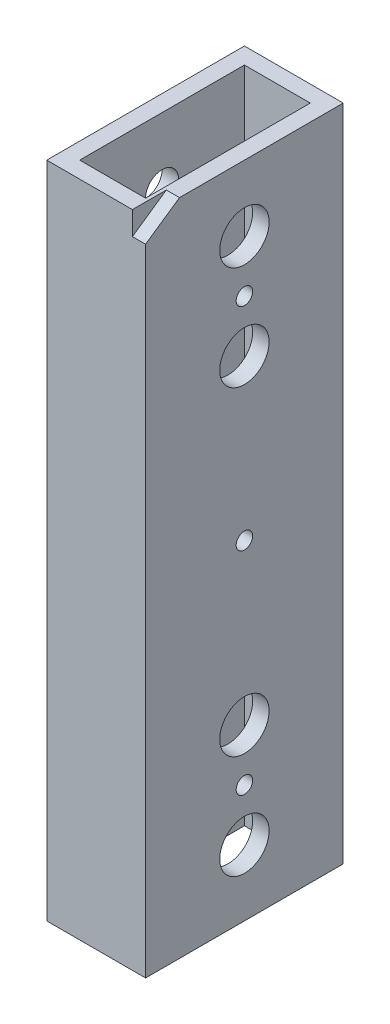
ISO-10303-21;
HEADER;
FILE_DESCRIPTION(('STEP AP214'),'2;1');
FILE_NAME('part.step','',(''),(''),'','','');
FILE_SCHEMA(('AUTOMOTIVE_DESIGN { 1 0 10303 214 1 1 1 1 }'));
ENDSEC;
DATA;
#1=APPLICATION_CONTEXT('core data for automotive mechanical design processes');
#2=APPLICATION_PROTOCOL_DEFINITION('international standard','automotive_design',2000,#1);
#3=PRODUCT_CONTEXT('',#1,'mechanical');
#4=PRODUCT('Part','Part','',(#3));
#5=PRODUCT_RELATED_PRODUCT_CATEGORY('part','',(#4));
#6=PRODUCT_DEFINITION_FORMATION('','',#4);
#7=PRODUCT_DEFINITION_CONTEXT('part definition',#1,'design');
#8=PRODUCT_DEFINITION('design','',#6,#7);
#9=PRODUCT_DEFINITION_SHAPE('','',#8);
#10=(LENGTH_UNIT() NAMED_UNIT(*) SI_UNIT(.MILLI.,.METRE.));
#11=(NAMED_UNIT(*) PLANE_ANGLE_UNIT() SI_UNIT($,.RADIAN.));
#12=(NAMED_UNIT(*) SI_UNIT($,.STERADIAN.) SOLID_ANGLE_UNIT());
#13=UNCERTAINTY_MEASURE_WITH_UNIT(LENGTH_MEASURE(1.E-05),#10,'distance_accuracy_value','');
#14=(GEOMETRIC_REPRESENTATION_CONTEXT(3) GLOBAL_UNCERTAINTY_ASSIGNED_CONTEXT((#13)) GLOBAL_UNIT_ASSIGNED_CONTEXT((#10,
#11,#12)) REPRESENTATION_CONTEXT('',''));
#15=CARTESIAN_POINT('',(0.,0.,0.));
#16=DIRECTION('',(0.,0.,1.));
#17=DIRECTION('',(1.,0.,0.));
#18=AXIS2_PLACEMENT_3D('',#15,#16,#17);
#19=CARTESIAN_POINT('',(0.,127.,0.));
#20=DIRECTION('',(0.,-1.,0.));
#21=DIRECTION('',(0.,0.,-1.));
#22=AXIS2_PLACEMENT_3D('',#19,#20,#21);
#23=PLANE('',#22);
#24=DIRECTION('',(0.,0.,1.));
#25=VECTOR('',#24,1.);
#26=CARTESIAN_POINT('',(16.51,127.,0.));
#27=LINE('',#26,#25);
#28=CARTESIAN_POINT('',(16.51,127.,-6.53736659995729));
#29=VERTEX_POINT('',#28);
#30=CARTESIAN_POINT('',(16.51,127.,0.));
#31=VERTEX_POINT('',#30);
#32=EDGE_CURVE('E129',#29,#31,#27,.T.);
#33=ORIENTED_EDGE('',*,*,#32,.F.);
#34=DIRECTION('',(1.,0.,0.));
#35=VECTOR('',#34,1.);
#36=CARTESIAN_POINT('',(16.51,127.,-6.53736659995729));
#37=LINE('',#36,#35);
#38=CARTESIAN_POINT('',(19.05,127.,-6.53736659995729));
#39=VERTEX_POINT('',#38);
#40=EDGE_CURVE('E126',#29,#39,#37,.T.);
#41=ORIENTED_EDGE('',*,*,#40,.T.);
#42=DIRECTION('',(0.,0.,-1.));
#43=VECTOR('',#42,1.);
#44=CARTESIAN_POINT('',(19.05,127.,0.));
#45=LINE('',#44,#43);
#46=CARTESIAN_POINT('',(19.05,127.,-38.1));
#47=VERTEX_POINT('',#46);
#48=EDGE_CURVE('E266',#39,#47,#45,.T.);
#49=ORIENTED_EDGE('',*,*,#48,.T.);
#50=DIRECTION('',(-1.,0.,0.));
#51=VECTOR('',#50,1.);
#52=CARTESIAN_POINT('',(0.,127.,-38.1));
#53=LINE('',#52,#51);
#54=CARTESIAN_POINT('',(0.,127.,-38.1));
#55=VERTEX_POINT('',#54);
#56=EDGE_CURVE('E269',#47,#55,#53,.T.);
#57=ORIENTED_EDGE('',*,*,#56,.T.);
#58=DIRECTION('',(0.,0.,1.));
#59=VECTOR('',#58,1.);
#60=CARTESIAN_POINT('',(0.,127.,0.));
#61=LINE('',#60,#59);
#62=CARTESIAN_POINT('',(0.,127.,0.));
#63=VERTEX_POINT('',#62);
#64=EDGE_CURVE('E259',#55,#63,#61,.T.);
#65=ORIENTED_EDGE('',*,*,#64,.T.);
#66=DIRECTION('',(1.,0.,0.));
#67=VECTOR('',#66,1.);
#68=CARTESIAN_POINT('',(0.,127.,0.));
#69=LINE('',#68,#67);
#70=EDGE_CURVE('E263',#63,#31,#69,.T.);
#71=ORIENTED_EDGE('',*,*,#70,.T.);
#72=EDGE_LOOP('',(#33,#41,#49,#57,#65,#71));
#73=FACE_BOUND('',#72,.T.);
#74=DIRECTION('',(0.,0.,1.));
#75=VECTOR('',#74,1.);
#76=CARTESIAN_POINT('',(3.175,127.,-3.175));
#77=LINE('',#76,#75);
#78=CARTESIAN_POINT('',(3.175,127.,-34.925));
#79=VERTEX_POINT('',#78);
#80=CARTESIAN_POINT('',(3.175,127.,-3.175));
#81=VERTEX_POINT('',#80);
#82=EDGE_CURVE('E225',#79,#81,#77,.T.);
#83=ORIENTED_EDGE('',*,*,#82,.F.);
#84=DIRECTION('',(-1.,0.,0.));
#85=VECTOR('',#84,1.);
#86=CARTESIAN_POINT('',(3.175,127.,-34.925));
#87=LINE('',#86,#85);
#88=CARTESIAN_POINT('',(15.875,127.,-34.925));
#89=VERTEX_POINT('',#88);
#90=EDGE_CURVE('E234',#89,#79,#87,.T.);
#91=ORIENTED_EDGE('',*,*,#90,.F.);
#92=DIRECTION('',(0.,0.,-1.));
#93=VECTOR('',#92,1.);
#94=CARTESIAN_POINT('',(15.875,127.,-3.175));
#95=LINE('',#94,#93);
#96=CARTESIAN_POINT('',(15.875,127.,-3.175));
#97=VERTEX_POINT('',#96);
#98=EDGE_CURVE('E231',#97,#89,#95,.T.);
#99=ORIENTED_EDGE('',*,*,#98,.F.);
#100=DIRECTION('',(1.,0.,0.));
#101=VECTOR('',#100,1.);
#102=CARTESIAN_POINT('',(3.175,127.,-3.175));
#103=LINE('',#102,#101);
#104=EDGE_CURVE('E228',#81,#97,#103,.T.);
#105=ORIENTED_EDGE('',*,*,#104,.F.);
#106=EDGE_LOOP('',(#83,#91,#99,#105));
#107=FACE_BOUND('',#106,.T.);
#108=ADVANCED_FACE('F41',(#73,#107),#23,.F.);
#109=CARTESIAN_POINT('',(0.,0.,0.));
#110=DIRECTION('',(0.,-1.,0.));
#111=DIRECTION('',(0.,0.,-1.));
#112=AXIS2_PLACEMENT_3D('',#109,#110,#111);
#113=PLANE('',#112);
#114=DIRECTION('',(0.,0.,1.));
#115=VECTOR('',#114,1.);
#116=CARTESIAN_POINT('',(0.,0.,0.));
#117=LINE('',#116,#115);
#118=CARTESIAN_POINT('',(0.,0.,-38.1));
#119=VERTEX_POINT('',#118);
#120=CARTESIAN_POINT('',(0.,0.,0.));
#121=VERTEX_POINT('',#120);
#122=EDGE_CURVE('E258',#119,#121,#117,.T.);
#123=ORIENTED_EDGE('',*,*,#122,.F.);
#124=DIRECTION('',(-1.,0.,0.));
#125=VECTOR('',#124,1.);
#126=CARTESIAN_POINT('',(0.,0.,-38.1));
#127=LINE('',#126,#125);
#128=CARTESIAN_POINT('',(19.05,0.,-38.1));
#129=VERTEX_POINT('',#128);
#130=EDGE_CURVE('E264',#129,#119,#127,.T.);
#131=ORIENTED_EDGE('',*,*,#130,.F.);
#132=DIRECTION('',(0.,0.,-1.));
#133=VECTOR('',#132,1.);
#134=CARTESIAN_POINT('',(19.05,0.,0.));
#135=LINE('',#134,#133);
#136=CARTESIAN_POINT('',(19.05,0.,0.));
#137=VERTEX_POINT('',#136);
#138=EDGE_CURVE('E277',#137,#129,#135,.T.);
#139=ORIENTED_EDGE('',*,*,#138,.F.);
#140=DIRECTION('',(1.,0.,0.));
#141=VECTOR('',#140,1.);
#142=CARTESIAN_POINT('',(0.,0.,0.));
#143=LINE('',#142,#141);
#144=EDGE_CURVE('E275',#121,#137,#143,.T.);
#145=ORIENTED_EDGE('',*,*,#144,.F.);
#146=EDGE_LOOP('',(#123,#131,#139,#145));
#147=FACE_BOUND('',#146,.T.);
#148=DIRECTION('',(-1.,0.,0.));
#149=VECTOR('',#148,1.);
#150=CARTESIAN_POINT('',(3.175,0.,-34.925));
#151=LINE('',#150,#149);
#152=CARTESIAN_POINT('',(15.875,0.,-34.925));
#153=VERTEX_POINT('',#152);
#154=CARTESIAN_POINT('',(3.175,0.,-34.925));
#155=VERTEX_POINT('',#154);
#156=EDGE_CURVE('E229',#153,#155,#151,.T.);
#157=ORIENTED_EDGE('',*,*,#156,.T.);
#158=DIRECTION('',(0.,0.,1.));
#159=VECTOR('',#158,1.);
#160=CARTESIAN_POINT('',(3.175,0.,-3.175));
#161=LINE('',#160,#159);
#162=CARTESIAN_POINT('',(3.175,0.,-3.175));
#163=VERTEX_POINT('',#162);
#164=EDGE_CURVE('E224',#155,#163,#161,.T.);
#165=ORIENTED_EDGE('',*,*,#164,.T.);
#166=DIRECTION('',(1.,0.,0.));
#167=VECTOR('',#166,1.);
#168=CARTESIAN_POINT('',(3.175,0.,-3.175));
#169=LINE('',#168,#167);
#170=CARTESIAN_POINT('',(15.875,0.,-3.175));
#171=VERTEX_POINT('',#170);
#172=EDGE_CURVE('E240',#163,#171,#169,.T.);
#173=ORIENTED_EDGE('',*,*,#172,.T.);
#174=DIRECTION('',(0.,0.,-1.));
#175=VECTOR('',#174,1.);
#176=CARTESIAN_POINT('',(15.875,0.,-3.175));
#177=LINE('',#176,#175);
#178=EDGE_CURVE('E243',#171,#153,#177,.T.);
#179=ORIENTED_EDGE('',*,*,#178,.T.);
#180=EDGE_LOOP('',(#157,#165,#173,#179));
#181=FACE_BOUND('',#180,.T.);
#182=ADVANCED_FACE('F320',(#147,#181),#113,.T.);
#183=CARTESIAN_POINT('',(0.,127.,0.));
#184=DIRECTION('',(1.,0.,0.));
#185=DIRECTION('',(0.,0.,-1.));
#186=AXIS2_PLACEMENT_3D('',#183,#184,#185);
#187=PLANE('',#186);
#188=CARTESIAN_POINT('',(0.,104.30002,-19.05));
#189=DIRECTION('',(-1.,0.,0.));
#190=DIRECTION('',(0.,0.,1.));
#191=AXIS2_PLACEMENT_3D('',#188,#189,#190);
#192=CIRCLE('',#191,4.7625);
#193=CARTESIAN_POINT('',(0.,104.30002,-14.2875));
#194=VERTEX_POINT('',#193);
#195=EDGE_CURVE('E147',#194,#194,#192,.T.);
#196=ORIENTED_EDGE('',*,*,#195,.F.);
#197=EDGE_LOOP('',(#196));
#198=FACE_BOUND('',#197,.T.);
#199=CARTESIAN_POINT('',(0.,63.5,-19.05));
#200=DIRECTION('',(-1.,0.,0.));
#201=DIRECTION('',(0.,0.,1.));
#202=AXIS2_PLACEMENT_3D('',#199,#200,#201);
#203=CIRCLE('',#202,4.7625);
#204=CARTESIAN_POINT('',(0.,63.5,-14.2875));
#205=VERTEX_POINT('',#204);
#206=EDGE_CURVE('E154',#205,#205,#203,.T.);
#207=ORIENTED_EDGE('',*,*,#206,.F.);
#208=EDGE_LOOP('',(#207));
#209=FACE_BOUND('',#208,.T.);
#210=CARTESIAN_POINT('',(0.,22.69998,-19.05));
#211=DIRECTION('',(-1.,0.,0.));
#212=DIRECTION('',(0.,0.,1.));
#213=AXIS2_PLACEMENT_3D('',#210,#211,#212);
#214=CIRCLE('',#213,4.7625);
#215=CARTESIAN_POINT('',(0.,22.69998,-14.2875));
#216=VERTEX_POINT('',#215);
#217=EDGE_CURVE('E160',#216,#216,#214,.T.);
#218=ORIENTED_EDGE('',*,*,#217,.F.);
#219=EDGE_LOOP('',(#218));
#220=FACE_BOUND('',#219,.T.);
#221=CARTESIAN_POINT('',(0.,12.7,-19.05));
#222=DIRECTION('',(1.,0.,0.));
#223=DIRECTION('',(0.,0.,-1.));
#224=AXIS2_PLACEMENT_3D('',#221,#222,#223);
#225=CIRCLE('',#224,3.175);
#226=CARTESIAN_POINT('',(0.,12.7,-22.225));
#227=VERTEX_POINT('',#226);
#228=EDGE_CURVE('E201',#227,#227,#225,.T.);
#229=ORIENTED_EDGE('',*,*,#228,.T.);
#230=EDGE_LOOP('',(#229));
#231=FACE_BOUND('',#230,.T.);
#232=CARTESIAN_POINT('',(0.,32.69996,-19.05));
#233=DIRECTION('',(1.,0.,0.));
#234=DIRECTION('',(0.,0.,-1.));
#235=AXIS2_PLACEMENT_3D('',#232,#233,#234);
#236=CIRCLE('',#235,3.175);
#237=CARTESIAN_POINT('',(0.,32.69996,-22.225));
#238=VERTEX_POINT('',#237);
#239=EDGE_CURVE('E205',#238,#238,#236,.T.);
#240=ORIENTED_EDGE('',*,*,#239,.T.);
#241=EDGE_LOOP('',(#240));
#242=FACE_BOUND('',#241,.T.);
#243=CARTESIAN_POINT('',(0.,94.30004,-19.05));
#244=DIRECTION('',(1.,0.,0.));
#245=DIRECTION('',(0.,0.,1.));
#246=AXIS2_PLACEMENT_3D('',#243,#244,#245);
#247=CIRCLE('',#246,3.175);
#248=CARTESIAN_POINT('',(0.,94.30004,-15.875));
#249=VERTEX_POINT('',#248);
#250=EDGE_CURVE('E208',#249,#249,#247,.T.);
#251=ORIENTED_EDGE('',*,*,#250,.T.);
#252=EDGE_LOOP('',(#251));
#253=FACE_BOUND('',#252,.T.);
#254=CARTESIAN_POINT('',(0.,114.3,-19.05));
#255=DIRECTION('',(1.,0.,0.));
#256=DIRECTION('',(0.,0.,1.));
#257=AXIS2_PLACEMENT_3D('',#254,#255,#256);
#258=CIRCLE('',#257,3.175);
#259=CARTESIAN_POINT('',(0.,114.3,-15.875));
#260=VERTEX_POINT('',#259);
#261=EDGE_CURVE('E178',#260,#260,#258,.T.);
#262=ORIENTED_EDGE('',*,*,#261,.T.);
#263=EDGE_LOOP('',(#262));
#264=FACE_BOUND('',#263,.T.);
#265=ORIENTED_EDGE('',*,*,#122,.T.);
#266=DIRECTION('',(0.,-1.,0.));
#267=VECTOR('',#266,1.);
#268=CARTESIAN_POINT('',(0.,127.,0.));
#269=LINE('',#268,#267);
#270=EDGE_CURVE('E11',#63,#121,#269,.T.);
#271=ORIENTED_EDGE('',*,*,#270,.F.);
#272=ORIENTED_EDGE('',*,*,#64,.F.);
#273=DIRECTION('',(0.,-1.,0.));
#274=VECTOR('',#273,1.);
#275=CARTESIAN_POINT('',(0.,127.,-38.1));
#276=LINE('',#275,#274);
#277=EDGE_CURVE('E272',#55,#119,#276,.T.);
#278=ORIENTED_EDGE('',*,*,#277,.T.);
#279=EDGE_LOOP('',(#265,#271,#272,#278));
#280=FACE_BOUND('',#279,.T.);
#281=ADVANCED_FACE('F43',(#198,#209,#220,#231,#242,#253,#264,#280),#187,.F.);
#282=CARTESIAN_POINT('',(0.,127.,0.));
#283=DIRECTION('',(0.,0.,-1.));
#284=DIRECTION('',(-1.,0.,0.));
#285=AXIS2_PLACEMENT_3D('',#282,#283,#284);
#286=PLANE('',#285);
#287=DIRECTION('',(0.,-1.,0.));
#288=VECTOR('',#287,1.);
#289=CARTESIAN_POINT('',(19.05,127.,0.));
#290=LINE('',#289,#288);
#291=CARTESIAN_POINT('',(19.05,122.487604509899,0.));
#292=VERTEX_POINT('',#291);
#293=EDGE_CURVE('E50',#292,#137,#290,.T.);
#294=ORIENTED_EDGE('',*,*,#293,.F.);
#295=DIRECTION('',(1.,0.,0.));
#296=VECTOR('',#295,1.);
#297=CARTESIAN_POINT('',(16.51,122.487604509899,0.));
#298=LINE('',#297,#296);
#299=CARTESIAN_POINT('',(16.51,122.487604509899,0.));
#300=VERTEX_POINT('',#299);
#301=EDGE_CURVE('E58',#300,#292,#298,.T.);
#302=ORIENTED_EDGE('',*,*,#301,.F.);
#303=DIRECTION('',(0.,-1.,0.));
#304=VECTOR('',#303,1.);
#305=CARTESIAN_POINT('',(16.51,122.487604509899,0.));
#306=LINE('',#305,#304);
#307=EDGE_CURVE('E130',#31,#300,#306,.T.);
#308=ORIENTED_EDGE('',*,*,#307,.F.);
#309=ORIENTED_EDGE('',*,*,#70,.F.);
#310=ORIENTED_EDGE('',*,*,#270,.T.);
#311=ORIENTED_EDGE('',*,*,#144,.T.);
#312=EDGE_LOOP('',(#294,#302,#308,#309,#310,#311));
#313=FACE_BOUND('',#312,.T.);
#314=ADVANCED_FACE('F139',(#313),#286,.F.);
#315=CARTESIAN_POINT('',(19.05,127.,0.));
#316=DIRECTION('',(-1.,0.,0.));
#317=DIRECTION('',(0.,0.,1.));
#318=AXIS2_PLACEMENT_3D('',#315,#316,#317);
#319=PLANE('',#318);
#320=CARTESIAN_POINT('',(19.05,22.69998,-19.05));
#321=DIRECTION('',(1.,0.,0.));
#322=DIRECTION('',(0.,0.,-1.));
#323=AXIS2_PLACEMENT_3D('',#320,#321,#322);
#324=CIRCLE('',#323,1.5875);
#325=CARTESIAN_POINT('',(19.05,22.69998,-20.6375));
#326=VERTEX_POINT('',#325);
#327=EDGE_CURVE('E165',#326,#326,#324,.T.);
#328=ORIENTED_EDGE('',*,*,#327,.F.);
#329=EDGE_LOOP('',(#328));
#330=FACE_BOUND('',#329,.T.);
#331=CARTESIAN_POINT('',(19.05,63.5,-19.05));
#332=DIRECTION('',(1.,0.,0.));
#333=DIRECTION('',(0.,0.,-1.));
#334=AXIS2_PLACEMENT_3D('',#331,#332,#333);
#335=CIRCLE('',#334,1.5875);
#336=CARTESIAN_POINT('',(19.05,63.5,-20.6375));
#337=VERTEX_POINT('',#336);
#338=EDGE_CURVE('E169',#337,#337,#335,.T.);
#339=ORIENTED_EDGE('',*,*,#338,.F.);
#340=EDGE_LOOP('',(#339));
#341=FACE_BOUND('',#340,.T.);
#342=CARTESIAN_POINT('',(19.05,104.30002,-19.05));
#343=DIRECTION('',(1.,0.,0.));
#344=DIRECTION('',(0.,0.,1.));
#345=AXIS2_PLACEMENT_3D('',#342,#343,#344);
#346=CIRCLE('',#345,1.5875);
#347=CARTESIAN_POINT('',(19.05,104.30002,-17.4625));
#348=VERTEX_POINT('',#347);
#349=EDGE_CURVE('E150',#348,#348,#346,.T.);
#350=ORIENTED_EDGE('',*,*,#349,.F.);
#351=EDGE_LOOP('',(#350));
#352=FACE_BOUND('',#351,.T.);
#353=CARTESIAN_POINT('',(19.05,114.3,-19.05));
#354=DIRECTION('',(1.,0.,0.));
#355=DIRECTION('',(0.,0.,-1.));
#356=AXIS2_PLACEMENT_3D('',#353,#354,#355);
#357=CIRCLE('',#356,4.7625);
#358=CARTESIAN_POINT('',(19.05,114.3,-23.8125));
#359=VERTEX_POINT('',#358);
#360=EDGE_CURVE('E174',#359,#359,#357,.T.);
#361=ORIENTED_EDGE('',*,*,#360,.F.);
#362=EDGE_LOOP('',(#361));
#363=FACE_BOUND('',#362,.T.);
#364=CARTESIAN_POINT('',(19.05,94.30004,-19.05));
#365=DIRECTION('',(1.,0.,0.));
#366=DIRECTION('',(0.,0.,-1.));
#367=AXIS2_PLACEMENT_3D('',#364,#365,#366);
#368=CIRCLE('',#367,4.7625);
#369=CARTESIAN_POINT('',(19.05,94.30004,-23.8125));
#370=VERTEX_POINT('',#369);
#371=EDGE_CURVE('E183',#370,#370,#368,.T.);
#372=ORIENTED_EDGE('',*,*,#371,.F.);
#373=EDGE_LOOP('',(#372));
#374=FACE_BOUND('',#373,.T.);
#375=CARTESIAN_POINT('',(19.05,32.69996,-19.05));
#376=DIRECTION('',(1.,0.,0.));
#377=DIRECTION('',(0.,0.,-1.));
#378=AXIS2_PLACEMENT_3D('',#375,#376,#377);
#379=CIRCLE('',#378,4.7625);
#380=CARTESIAN_POINT('',(19.05,32.69996,-23.8125));
#381=VERTEX_POINT('',#380);
#382=EDGE_CURVE('E189',#381,#381,#379,.T.);
#383=ORIENTED_EDGE('',*,*,#382,.F.);
#384=EDGE_LOOP('',(#383));
#385=FACE_BOUND('',#384,.T.);
#386=CARTESIAN_POINT('',(19.05,12.7,-19.05));
#387=DIRECTION('',(1.,0.,0.));
#388=DIRECTION('',(0.,0.,-1.));
#389=AXIS2_PLACEMENT_3D('',#386,#387,#388);
#390=CIRCLE('',#389,4.7625);
#391=CARTESIAN_POINT('',(19.05,12.7,-23.8125));
#392=VERTEX_POINT('',#391);
#393=EDGE_CURVE('E195',#392,#392,#390,.T.);
#394=ORIENTED_EDGE('',*,*,#393,.F.);
#395=EDGE_LOOP('',(#394));
#396=FACE_BOUND('',#395,.T.);
#397=ORIENTED_EDGE('',*,*,#48,.F.);
#398=DIRECTION('',(0.,0.568062797194208,-0.822985211558441));
#399=VECTOR('',#398,1.);
#400=CARTESIAN_POINT('',(19.05,127.,-6.53736659995729));
#401=LINE('',#400,#399);
#402=EDGE_CURVE('E136',#292,#39,#401,.T.);
#403=ORIENTED_EDGE('',*,*,#402,.F.);
#404=ORIENTED_EDGE('',*,*,#293,.T.);
#405=ORIENTED_EDGE('',*,*,#138,.T.);
#406=DIRECTION('',(0.,-1.,0.));
#407=VECTOR('',#406,1.);
#408=CARTESIAN_POINT('',(19.05,127.,-38.1));
#409=LINE('',#408,#407);
#410=EDGE_CURVE('E283',#47,#129,#409,.T.);
#411=ORIENTED_EDGE('',*,*,#410,.F.);
#412=EDGE_LOOP('',(#397,#403,#404,#405,#411));
#413=FACE_BOUND('',#412,.T.);
#414=ADVANCED_FACE('F356',(#330,#341,#352,#363,#374,#385,#396,#413),#319,.F.);
#415=CARTESIAN_POINT('',(0.,127.,-38.1));
#416=DIRECTION('',(0.,0.,1.));
#417=DIRECTION('',(1.,0.,0.));
#418=AXIS2_PLACEMENT_3D('',#415,#416,#417);
#419=PLANE('',#418);
#420=ORIENTED_EDGE('',*,*,#130,.T.);
#421=ORIENTED_EDGE('',*,*,#277,.F.);
#422=ORIENTED_EDGE('',*,*,#56,.F.);
#423=ORIENTED_EDGE('',*,*,#410,.T.);
#424=EDGE_LOOP('',(#420,#421,#422,#423));
#425=FACE_BOUND('',#424,.T.);
#426=ADVANCED_FACE('F353',(#425),#419,.F.);
#427=CARTESIAN_POINT('',(3.175,127.,-3.175));
#428=DIRECTION('',(1.,0.,0.));
#429=DIRECTION('',(0.,0.,-1.));
#430=AXIS2_PLACEMENT_3D('',#427,#428,#429);
#431=PLANE('',#430);
#432=CARTESIAN_POINT('',(3.175,104.30002,-19.05));
#433=DIRECTION('',(1.,0.,0.));
#434=DIRECTION('',(0.,0.,-1.));
#435=AXIS2_PLACEMENT_3D('',#432,#433,#434);
#436=CIRCLE('',#435,4.7625);
#437=CARTESIAN_POINT('',(3.175,104.30002,-23.8125));
#438=VERTEX_POINT('',#437);
#439=EDGE_CURVE('E151',#438,#438,#436,.F.);
#440=ORIENTED_EDGE('',*,*,#439,.T.);
#441=EDGE_LOOP('',(#440));
#442=FACE_BOUND('',#441,.T.);
#443=CARTESIAN_POINT('',(3.175,63.5,-19.05));
#444=DIRECTION('',(1.,0.,0.));
#445=DIRECTION('',(0.,0.,-1.));
#446=AXIS2_PLACEMENT_3D('',#443,#444,#445);
#447=CIRCLE('',#446,4.7625);
#448=CARTESIAN_POINT('',(3.175,63.5,-23.8125));
#449=VERTEX_POINT('',#448);
#450=EDGE_CURVE('E157',#449,#449,#447,.F.);
#451=ORIENTED_EDGE('',*,*,#450,.T.);
#452=EDGE_LOOP('',(#451));
#453=FACE_BOUND('',#452,.T.);
#454=CARTESIAN_POINT('',(3.175,22.69998,-19.05));
#455=DIRECTION('',(1.,0.,0.));
#456=DIRECTION('',(0.,0.,-1.));
#457=AXIS2_PLACEMENT_3D('',#454,#455,#456);
#458=CIRCLE('',#457,4.7625);
#459=CARTESIAN_POINT('',(3.175,22.69998,-23.8125));
#460=VERTEX_POINT('',#459);
#461=EDGE_CURVE('E142',#460,#460,#458,.F.);
#462=ORIENTED_EDGE('',*,*,#461,.T.);
#463=EDGE_LOOP('',(#462));
#464=FACE_BOUND('',#463,.T.);
#465=CARTESIAN_POINT('',(3.175,12.7,-19.05));
#466=DIRECTION('',(1.,0.,0.));
#467=DIRECTION('',(0.,0.,-1.));
#468=AXIS2_PLACEMENT_3D('',#465,#466,#467);
#469=CIRCLE('',#468,3.175);
#470=CARTESIAN_POINT('',(3.175,12.7,-22.225));
#471=VERTEX_POINT('',#470);
#472=EDGE_CURVE('E221',#471,#471,#469,.T.);
#473=ORIENTED_EDGE('',*,*,#472,.F.);
#474=EDGE_LOOP('',(#473));
#475=FACE_BOUND('',#474,.T.);
#476=CARTESIAN_POINT('',(3.175,32.69996,-19.05));
#477=DIRECTION('',(1.,0.,0.));
#478=DIRECTION('',(0.,0.,-1.));
#479=AXIS2_PLACEMENT_3D('',#476,#477,#478);
#480=CIRCLE('',#479,3.175);
#481=CARTESIAN_POINT('',(3.175,32.69996,-22.225));
#482=VERTEX_POINT('',#481);
#483=EDGE_CURVE('E218',#482,#482,#480,.T.);
#484=ORIENTED_EDGE('',*,*,#483,.F.);
#485=EDGE_LOOP('',(#484));
#486=FACE_BOUND('',#485,.T.);
#487=CARTESIAN_POINT('',(3.175,94.30004,-19.05));
#488=DIRECTION('',(1.,0.,0.));
#489=DIRECTION('',(0.,0.,-1.));
#490=AXIS2_PLACEMENT_3D('',#487,#488,#489);
#491=CIRCLE('',#490,3.175);
#492=CARTESIAN_POINT('',(3.175,94.30004,-22.225));
#493=VERTEX_POINT('',#492);
#494=EDGE_CURVE('E215',#493,#493,#491,.T.);
#495=ORIENTED_EDGE('',*,*,#494,.F.);
#496=EDGE_LOOP('',(#495));
#497=FACE_BOUND('',#496,.T.);
#498=CARTESIAN_POINT('',(3.175,114.3,-19.05));
#499=DIRECTION('',(1.,0.,0.));
#500=DIRECTION('',(0.,0.,-1.));
#501=AXIS2_PLACEMENT_3D('',#498,#499,#500);
#502=CIRCLE('',#501,3.175);
#503=CARTESIAN_POINT('',(3.175,114.3,-22.225));
#504=VERTEX_POINT('',#503);
#505=EDGE_CURVE('E204',#504,#504,#502,.T.);
#506=ORIENTED_EDGE('',*,*,#505,.F.);
#507=EDGE_LOOP('',(#506));
#508=FACE_BOUND('',#507,.T.);
#509=ORIENTED_EDGE('',*,*,#164,.F.);
#510=DIRECTION('',(0.,-1.,0.));
#511=VECTOR('',#510,1.);
#512=CARTESIAN_POINT('',(3.175,127.,-34.925));
#513=LINE('',#512,#511);
#514=EDGE_CURVE('E237',#79,#155,#513,.T.);
#515=ORIENTED_EDGE('',*,*,#514,.F.);
#516=ORIENTED_EDGE('',*,*,#82,.T.);
#517=DIRECTION('',(0.,-1.,0.));
#518=VECTOR('',#517,1.);
#519=CARTESIAN_POINT('',(3.175,127.,-3.175));
#520=LINE('',#519,#518);
#521=EDGE_CURVE('E255',#81,#163,#520,.T.);
#522=ORIENTED_EDGE('',*,*,#521,.T.);
#523=EDGE_LOOP('',(#509,#515,#516,#522));
#524=FACE_BOUND('',#523,.T.);
#525=ADVANCED_FACE('F325',(#442,#453,#464,#475,#486,#497,#508,#524),#431,.T.);
#526=CARTESIAN_POINT('',(3.175,127.,-3.175));
#527=DIRECTION('',(0.,0.,-1.));
#528=DIRECTION('',(-1.,0.,0.));
#529=AXIS2_PLACEMENT_3D('',#526,#527,#528);
#530=PLANE('',#529);
#531=ORIENTED_EDGE('',*,*,#172,.F.);
#532=ORIENTED_EDGE('',*,*,#521,.F.);
#533=ORIENTED_EDGE('',*,*,#104,.T.);
#534=DIRECTION('',(0.,-1.,0.));
#535=VECTOR('',#534,1.);
#536=CARTESIAN_POINT('',(15.875,127.,-3.175));
#537=LINE('',#536,#535);
#538=EDGE_CURVE('E253',#97,#171,#537,.T.);
#539=ORIENTED_EDGE('',*,*,#538,.T.);
#540=EDGE_LOOP('',(#531,#532,#533,#539));
#541=FACE_BOUND('',#540,.T.);
#542=ADVANCED_FACE('F303',(#541),#530,.T.);
#543=CARTESIAN_POINT('',(15.875,127.,-3.175));
#544=DIRECTION('',(-1.,0.,0.));
#545=DIRECTION('',(0.,0.,1.));
#546=AXIS2_PLACEMENT_3D('',#543,#544,#545);
#547=PLANE('',#546);
#548=CARTESIAN_POINT('',(15.875,22.69998,-19.05));
#549=DIRECTION('',(-1.,0.,0.));
#550=DIRECTION('',(0.,0.,1.));
#551=AXIS2_PLACEMENT_3D('',#548,#549,#550);
#552=CIRCLE('',#551,1.5875);
#553=CARTESIAN_POINT('',(15.875,22.69998,-17.4625));
#554=VERTEX_POINT('',#553);
#555=EDGE_CURVE('E45',#554,#554,#552,.T.);
#556=ORIENTED_EDGE('',*,*,#555,.F.);
#557=EDGE_LOOP('',(#556));
#558=FACE_BOUND('',#557,.T.);
#559=CARTESIAN_POINT('',(15.875,63.5,-19.05));
#560=DIRECTION('',(-1.,0.,0.));
#561=DIRECTION('',(0.,0.,1.));
#562=AXIS2_PLACEMENT_3D('',#559,#560,#561);
#563=CIRCLE('',#562,1.5875);
#564=CARTESIAN_POINT('',(15.875,63.5,-17.4625));
#565=VERTEX_POINT('',#564);
#566=EDGE_CURVE('E289',#565,#565,#563,.T.);
#567=ORIENTED_EDGE('',*,*,#566,.F.);
#568=EDGE_LOOP('',(#567));
#569=FACE_BOUND('',#568,.T.);
#570=CARTESIAN_POINT('',(15.875,104.30002,-19.05));
#571=DIRECTION('',(-1.,0.,0.));
#572=DIRECTION('',(0.,0.,1.));
#573=AXIS2_PLACEMENT_3D('',#570,#571,#572);
#574=CIRCLE('',#573,1.5875);
#575=CARTESIAN_POINT('',(15.875,104.30002,-17.4625));
#576=VERTEX_POINT('',#575);
#577=EDGE_CURVE('E168',#576,#576,#574,.T.);
#578=ORIENTED_EDGE('',*,*,#577,.F.);
#579=EDGE_LOOP('',(#578));
#580=FACE_BOUND('',#579,.T.);
#581=CARTESIAN_POINT('',(15.875,114.3,-19.05));
#582=DIRECTION('',(-1.,0.,0.));
#583=DIRECTION('',(0.,0.,1.));
#584=AXIS2_PLACEMENT_3D('',#581,#582,#583);
#585=CIRCLE('',#584,4.7625);
#586=CARTESIAN_POINT('',(15.875,114.3,-14.2875));
#587=VERTEX_POINT('',#586);
#588=EDGE_CURVE('E179',#587,#587,#585,.F.);
#589=ORIENTED_EDGE('',*,*,#588,.T.);
#590=EDGE_LOOP('',(#589));
#591=FACE_BOUND('',#590,.T.);
#592=CARTESIAN_POINT('',(15.875,94.30004,-19.05));
#593=DIRECTION('',(-1.,0.,0.));
#594=DIRECTION('',(0.,0.,1.));
#595=AXIS2_PLACEMENT_3D('',#592,#593,#594);
#596=CIRCLE('',#595,4.7625);
#597=CARTESIAN_POINT('',(15.875,94.30004,-14.2875));
#598=VERTEX_POINT('',#597);
#599=EDGE_CURVE('E186',#598,#598,#596,.F.);
#600=ORIENTED_EDGE('',*,*,#599,.T.);
#601=EDGE_LOOP('',(#600));
#602=FACE_BOUND('',#601,.T.);
#603=CARTESIAN_POINT('',(15.875,32.69996,-19.05));
#604=DIRECTION('',(-1.,0.,0.));
#605=DIRECTION('',(0.,0.,1.));
#606=AXIS2_PLACEMENT_3D('',#603,#604,#605);
#607=CIRCLE('',#606,4.7625);
#608=CARTESIAN_POINT('',(15.875,32.69996,-14.2875));
#609=VERTEX_POINT('',#608);
#610=EDGE_CURVE('E192',#609,#609,#607,.F.);
#611=ORIENTED_EDGE('',*,*,#610,.T.);
#612=EDGE_LOOP('',(#611));
#613=FACE_BOUND('',#612,.T.);
#614=CARTESIAN_POINT('',(15.875,12.7,-19.05));
#615=DIRECTION('',(-1.,0.,0.));
#616=DIRECTION('',(0.,0.,1.));
#617=AXIS2_PLACEMENT_3D('',#614,#615,#616);
#618=CIRCLE('',#617,4.7625);
#619=CARTESIAN_POINT('',(15.875,12.7,-14.2875));
#620=VERTEX_POINT('',#619);
#621=EDGE_CURVE('E198',#620,#620,#618,.F.);
#622=ORIENTED_EDGE('',*,*,#621,.T.);
#623=EDGE_LOOP('',(#622));
#624=FACE_BOUND('',#623,.T.);
#625=ORIENTED_EDGE('',*,*,#178,.F.);
#626=ORIENTED_EDGE('',*,*,#538,.F.);
#627=ORIENTED_EDGE('',*,*,#98,.T.);
#628=DIRECTION('',(0.,-1.,0.));
#629=VECTOR('',#628,1.);
#630=CARTESIAN_POINT('',(15.875,127.,-34.925));
#631=LINE('',#630,#629);
#632=EDGE_CURVE('E69',#89,#153,#631,.T.);
#633=ORIENTED_EDGE('',*,*,#632,.T.);
#634=EDGE_LOOP('',(#625,#626,#627,#633));
#635=FACE_BOUND('',#634,.T.);
#636=ADVANCED_FACE('F299',(#558,#569,#580,#591,#602,#613,#624,#635),#547,.T.);
#637=CARTESIAN_POINT('',(3.175,127.,-34.925));
#638=DIRECTION('',(0.,0.,1.));
#639=DIRECTION('',(1.,0.,0.));
#640=AXIS2_PLACEMENT_3D('',#637,#638,#639);
#641=PLANE('',#640);
#642=ORIENTED_EDGE('',*,*,#156,.F.);
#643=ORIENTED_EDGE('',*,*,#632,.F.);
#644=ORIENTED_EDGE('',*,*,#90,.T.);
#645=ORIENTED_EDGE('',*,*,#514,.T.);
#646=EDGE_LOOP('',(#642,#643,#644,#645));
#647=FACE_BOUND('',#646,.T.);
#648=ADVANCED_FACE('F302',(#647),#641,.T.);
#649=CARTESIAN_POINT('',(0.,114.3,-19.05));
#650=DIRECTION('',(1.,0.,0.));
#651=DIRECTION('',(0.,0.,-1.));
#652=AXIS2_PLACEMENT_3D('',#649,#650,#651);
#653=CYLINDRICAL_SURFACE('',#652,3.175);
#654=ORIENTED_EDGE('',*,*,#505,.T.);
#655=EDGE_LOOP('',(#654));
#656=FACE_BOUND('',#655,.T.);
#657=ORIENTED_EDGE('',*,*,#261,.F.);
#658=EDGE_LOOP('',(#657));
#659=FACE_BOUND('',#658,.T.);
#660=ADVANCED_FACE('F331',(#656,#659),#653,.F.);
#661=CARTESIAN_POINT('',(0.,94.30004,-19.05));
#662=DIRECTION('',(1.,0.,0.));
#663=DIRECTION('',(0.,0.,-1.));
#664=AXIS2_PLACEMENT_3D('',#661,#662,#663);
#665=CYLINDRICAL_SURFACE('',#664,3.175);
#666=ORIENTED_EDGE('',*,*,#494,.T.);
#667=EDGE_LOOP('',(#666));
#668=FACE_BOUND('',#667,.T.);
#669=ORIENTED_EDGE('',*,*,#250,.F.);
#670=EDGE_LOOP('',(#669));
#671=FACE_BOUND('',#670,.T.);
#672=ADVANCED_FACE('F337',(#668,#671),#665,.F.);
#673=CARTESIAN_POINT('',(0.,32.69996,-19.05));
#674=DIRECTION('',(1.,0.,0.));
#675=DIRECTION('',(0.,0.,-1.));
#676=AXIS2_PLACEMENT_3D('',#673,#674,#675);
#677=CYLINDRICAL_SURFACE('',#676,3.175);
#678=ORIENTED_EDGE('',*,*,#483,.T.);
#679=EDGE_LOOP('',(#678));
#680=FACE_BOUND('',#679,.T.);
#681=ORIENTED_EDGE('',*,*,#239,.F.);
#682=EDGE_LOOP('',(#681));
#683=FACE_BOUND('',#682,.T.);
#684=ADVANCED_FACE('F394',(#680,#683),#677,.F.);
#685=CARTESIAN_POINT('',(0.,12.7,-19.05));
#686=DIRECTION('',(1.,0.,0.));
#687=DIRECTION('',(0.,0.,-1.));
#688=AXIS2_PLACEMENT_3D('',#685,#686,#687);
#689=CYLINDRICAL_SURFACE('',#688,3.175);
#690=ORIENTED_EDGE('',*,*,#472,.T.);
#691=EDGE_LOOP('',(#690));
#692=FACE_BOUND('',#691,.T.);
#693=ORIENTED_EDGE('',*,*,#228,.F.);
#694=EDGE_LOOP('',(#693));
#695=FACE_BOUND('',#694,.T.);
#696=ADVANCED_FACE('F400',(#692,#695),#689,.F.);
#697=CARTESIAN_POINT('',(-0.001000000000001,12.7,-19.05));
#698=DIRECTION('',(1.,0.,0.));
#699=DIRECTION('',(0.,0.,-1.));
#700=AXIS2_PLACEMENT_3D('',#697,#698,#699);
#701=CYLINDRICAL_SURFACE('',#700,4.7625);
#702=ORIENTED_EDGE('',*,*,#621,.F.);
#703=EDGE_LOOP('',(#702));
#704=FACE_BOUND('',#703,.T.);
#705=ORIENTED_EDGE('',*,*,#393,.T.);
#706=EDGE_LOOP('',(#705));
#707=FACE_BOUND('',#706,.T.);
#708=ADVANCED_FACE('F406',(#704,#707),#701,.F.);
#709=CARTESIAN_POINT('',(-0.001000000000001,32.69996,-19.05));
#710=DIRECTION('',(1.,0.,0.));
#711=DIRECTION('',(0.,0.,-1.));
#712=AXIS2_PLACEMENT_3D('',#709,#710,#711);
#713=CYLINDRICAL_SURFACE('',#712,4.7625);
#714=ORIENTED_EDGE('',*,*,#610,.F.);
#715=EDGE_LOOP('',(#714));
#716=FACE_BOUND('',#715,.T.);
#717=ORIENTED_EDGE('',*,*,#382,.T.);
#718=EDGE_LOOP('',(#717));
#719=FACE_BOUND('',#718,.T.);
#720=ADVANCED_FACE('F410',(#716,#719),#713,.F.);
#721=CARTESIAN_POINT('',(-0.001000000000001,94.30004,-19.05));
#722=DIRECTION('',(1.,0.,0.));
#723=DIRECTION('',(0.,0.,-1.));
#724=AXIS2_PLACEMENT_3D('',#721,#722,#723);
#725=CYLINDRICAL_SURFACE('',#724,4.7625);
#726=ORIENTED_EDGE('',*,*,#599,.F.);
#727=EDGE_LOOP('',(#726));
#728=FACE_BOUND('',#727,.T.);
#729=ORIENTED_EDGE('',*,*,#371,.T.);
#730=EDGE_LOOP('',(#729));
#731=FACE_BOUND('',#730,.T.);
#732=ADVANCED_FACE('F414',(#728,#731),#725,.F.);
#733=CARTESIAN_POINT('',(-0.001000000000001,114.3,-19.05));
#734=DIRECTION('',(1.,0.,0.));
#735=DIRECTION('',(0.,0.,-1.));
#736=AXIS2_PLACEMENT_3D('',#733,#734,#735);
#737=CYLINDRICAL_SURFACE('',#736,4.7625);
#738=ORIENTED_EDGE('',*,*,#588,.F.);
#739=EDGE_LOOP('',(#738));
#740=FACE_BOUND('',#739,.T.);
#741=ORIENTED_EDGE('',*,*,#360,.T.);
#742=EDGE_LOOP('',(#741));
#743=FACE_BOUND('',#742,.T.);
#744=ADVANCED_FACE('F418',(#740,#743),#737,.F.);
#745=CARTESIAN_POINT('',(0.,104.30002,-19.05));
#746=DIRECTION('',(1.,0.,0.));
#747=DIRECTION('',(0.,0.,-1.));
#748=AXIS2_PLACEMENT_3D('',#745,#746,#747);
#749=CYLINDRICAL_SURFACE('',#748,1.5875);
#750=ORIENTED_EDGE('',*,*,#577,.T.);
#751=EDGE_LOOP('',(#750));
#752=FACE_BOUND('',#751,.T.);
#753=ORIENTED_EDGE('',*,*,#349,.T.);
#754=EDGE_LOOP('',(#753));
#755=FACE_BOUND('',#754,.T.);
#756=ADVANCED_FACE('F422',(#752,#755),#749,.F.);
#757=CARTESIAN_POINT('',(0.,63.5,-19.05));
#758=DIRECTION('',(1.,0.,0.));
#759=DIRECTION('',(0.,0.,-1.));
#760=AXIS2_PLACEMENT_3D('',#757,#758,#759);
#761=CYLINDRICAL_SURFACE('',#760,1.5875);
#762=ORIENTED_EDGE('',*,*,#566,.T.);
#763=EDGE_LOOP('',(#762));
#764=FACE_BOUND('',#763,.T.);
#765=ORIENTED_EDGE('',*,*,#338,.T.);
#766=EDGE_LOOP('',(#765));
#767=FACE_BOUND('',#766,.T.);
#768=ADVANCED_FACE('F426',(#764,#767),#761,.F.);
#769=CARTESIAN_POINT('',(0.,22.69998,-19.05));
#770=DIRECTION('',(1.,0.,0.));
#771=DIRECTION('',(0.,0.,-1.));
#772=AXIS2_PLACEMENT_3D('',#769,#770,#771);
#773=CYLINDRICAL_SURFACE('',#772,1.5875);
#774=ORIENTED_EDGE('',*,*,#555,.T.);
#775=EDGE_LOOP('',(#774));
#776=FACE_BOUND('',#775,.T.);
#777=ORIENTED_EDGE('',*,*,#327,.T.);
#778=EDGE_LOOP('',(#777));
#779=FACE_BOUND('',#778,.T.);
#780=ADVANCED_FACE('F296',(#776,#779),#773,.F.);
#781=CARTESIAN_POINT('',(19.051,22.69998,-19.05));
#782=DIRECTION('',(-1.,0.,0.));
#783=DIRECTION('',(0.,0.,1.));
#784=AXIS2_PLACEMENT_3D('',#781,#782,#783);
#785=CYLINDRICAL_SURFACE('',#784,4.7625);
#786=ORIENTED_EDGE('',*,*,#461,.F.);
#787=EDGE_LOOP('',(#786));
#788=FACE_BOUND('',#787,.T.);
#789=ORIENTED_EDGE('',*,*,#217,.T.);
#790=EDGE_LOOP('',(#789));
#791=FACE_BOUND('',#790,.T.);
#792=ADVANCED_FACE('F432',(#788,#791),#785,.F.);
#793=CARTESIAN_POINT('',(19.051,63.5,-19.05));
#794=DIRECTION('',(-1.,0.,0.));
#795=DIRECTION('',(0.,0.,1.));
#796=AXIS2_PLACEMENT_3D('',#793,#794,#795);
#797=CYLINDRICAL_SURFACE('',#796,4.7625);
#798=ORIENTED_EDGE('',*,*,#450,.F.);
#799=EDGE_LOOP('',(#798));
#800=FACE_BOUND('',#799,.T.);
#801=ORIENTED_EDGE('',*,*,#206,.T.);
#802=EDGE_LOOP('',(#801));
#803=FACE_BOUND('',#802,.T.);
#804=ADVANCED_FACE('F435',(#800,#803),#797,.F.);
#805=CARTESIAN_POINT('',(19.051,104.30002,-19.05));
#806=DIRECTION('',(-1.,0.,0.));
#807=DIRECTION('',(0.,0.,1.));
#808=AXIS2_PLACEMENT_3D('',#805,#806,#807);
#809=CYLINDRICAL_SURFACE('',#808,4.7625);
#810=ORIENTED_EDGE('',*,*,#439,.F.);
#811=EDGE_LOOP('',(#810));
#812=FACE_BOUND('',#811,.T.);
#813=ORIENTED_EDGE('',*,*,#195,.T.);
#814=EDGE_LOOP('',(#813));
#815=FACE_BOUND('',#814,.T.);
#816=ADVANCED_FACE('F439',(#812,#815),#809,.F.);
#817=CARTESIAN_POINT('',(16.51,127.,-6.53736659995729));
#818=DIRECTION('',(0.,-0.822985211558441,-0.568062797194208));
#819=DIRECTION('',(0.,0.568062797194208,-0.822985211558441));
#820=AXIS2_PLACEMENT_3D('',#817,#818,#819);
#821=PLANE('',#820);
#822=ORIENTED_EDGE('',*,*,#402,.T.);
#823=ORIENTED_EDGE('',*,*,#40,.F.);
#824=DIRECTION('',(0.,0.568062797194208,-0.822985211558441));
#825=VECTOR('',#824,1.);
#826=CARTESIAN_POINT('',(16.51,127.,-6.53736659995729));
#827=LINE('',#826,#825);
#828=EDGE_CURVE('E122',#300,#29,#827,.T.);
#829=ORIENTED_EDGE('',*,*,#828,.F.);
#830=ORIENTED_EDGE('',*,*,#301,.T.);
#831=EDGE_LOOP('',(#822,#823,#829,#830));
#832=FACE_BOUND('',#831,.T.);
#833=ADVANCED_FACE('F124',(#832),#821,.F.);
#834=CARTESIAN_POINT('',(16.51,0.,0.));
#835=DIRECTION('',(-1.,0.,0.));
#836=DIRECTION('',(0.,0.,1.));
#837=AXIS2_PLACEMENT_3D('',#834,#835,#836);
#838=PLANE('',#837);
#839=ORIENTED_EDGE('',*,*,#307,.T.);
#840=ORIENTED_EDGE('',*,*,#828,.T.);
#841=ORIENTED_EDGE('',*,*,#32,.T.);
#842=EDGE_LOOP('',(#839,#840,#841));
#843=FACE_BOUND('',#842,.T.);
#844=ADVANCED_FACE('F133',(#843),#838,.F.);
#845=CLOSED_SHELL('',(#108,#182,#281,#314,#414,#426,#525,#542,#636,#648,#660,#672,#684,#696,
#708,#720,#732,#744,#756,#768,#780,#792,#804,#816,#833,#844));
#846=MANIFOLD_SOLID_BREP('B2',#845);
#847=ADVANCED_BREP_SHAPE_REPRESENTATION('',(#18,#846),#14);
#848=SHAPE_DEFINITION_REPRESENTATION(#9,#847);
ENDSEC;
END-ISO-10303-21;
